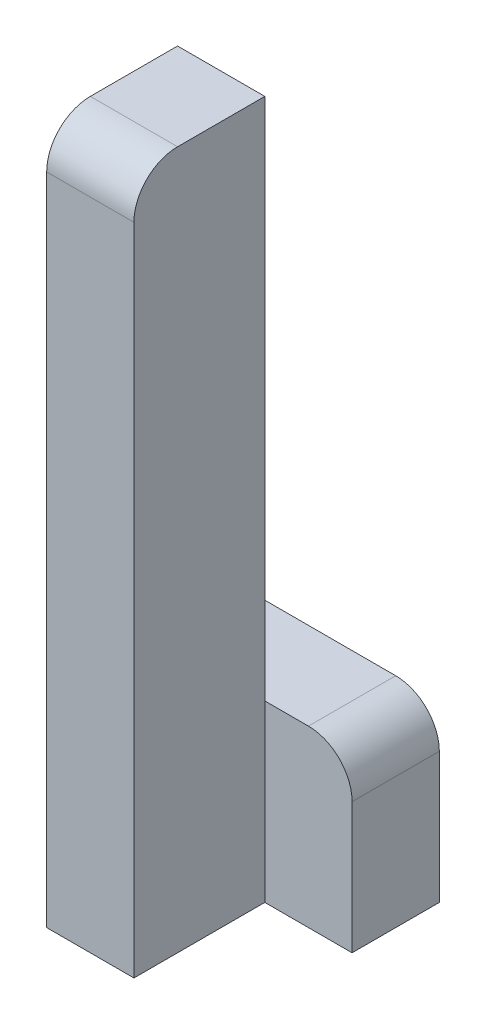
ISO-10303-21;
HEADER;
FILE_DESCRIPTION(('STEP AP214'),'2;1');
FILE_NAME('part.step','',(''),(''),'','','');
FILE_SCHEMA(('AUTOMOTIVE_DESIGN { 1 0 10303 214 1 1 1 1 }'));
ENDSEC;
DATA;
#1=APPLICATION_CONTEXT('core data for automotive mechanical design processes');
#2=APPLICATION_PROTOCOL_DEFINITION('international standard','automotive_design',2000,#1);
#3=PRODUCT_CONTEXT('',#1,'mechanical');
#4=PRODUCT('Part','Part','',(#3));
#5=PRODUCT_RELATED_PRODUCT_CATEGORY('part','',(#4));
#6=PRODUCT_DEFINITION_FORMATION('','',#4);
#7=PRODUCT_DEFINITION_CONTEXT('part definition',#1,'design');
#8=PRODUCT_DEFINITION('design','',#6,#7);
#9=PRODUCT_DEFINITION_SHAPE('','',#8);
#10=(LENGTH_UNIT() NAMED_UNIT(*) SI_UNIT(.MILLI.,.METRE.));
#11=(NAMED_UNIT(*) PLANE_ANGLE_UNIT() SI_UNIT($,.RADIAN.));
#12=(NAMED_UNIT(*) SI_UNIT($,.STERADIAN.) SOLID_ANGLE_UNIT());
#13=UNCERTAINTY_MEASURE_WITH_UNIT(LENGTH_MEASURE(1.E-05),#10,'distance_accuracy_value','');
#14=(GEOMETRIC_REPRESENTATION_CONTEXT(3) GLOBAL_UNCERTAINTY_ASSIGNED_CONTEXT((#13)) GLOBAL_UNIT_ASSIGNED_CONTEXT((#10,
#11,#12)) REPRESENTATION_CONTEXT('',''));
#15=CARTESIAN_POINT('',(0.,0.,0.));
#16=DIRECTION('',(0.,0.,1.));
#17=DIRECTION('',(1.,0.,0.));
#18=AXIS2_PLACEMENT_3D('',#15,#16,#17);
#19=CARTESIAN_POINT('',(-10.,0.,30.));
#20=DIRECTION('',(0.,-1.,0.));
#21=DIRECTION('',(1.,0.,0.));
#22=AXIS2_PLACEMENT_3D('',#19,#20,#21);
#23=PLANE('',#22);
#24=DIRECTION('',(0.,0.,-1.));
#25=VECTOR('',#24,1.);
#26=CARTESIAN_POINT('',(-30.,0.,30.));
#27=LINE('',#26,#25);
#28=CARTESIAN_POINT('',(-30.,0.,20.));
#29=VERTEX_POINT('',#28);
#30=CARTESIAN_POINT('',(-30.,0.,0.));
#31=VERTEX_POINT('',#30);
#32=EDGE_CURVE('E171',#29,#31,#27,.T.);
#33=ORIENTED_EDGE('',*,*,#32,.F.);
#34=DIRECTION('',(-1.,0.,0.));
#35=VECTOR('',#34,1.);
#36=CARTESIAN_POINT('',(-10.,0.,20.));
#37=LINE('',#36,#35);
#38=CARTESIAN_POINT('',(-10.,0.,20.));
#39=VERTEX_POINT('',#38);
#40=EDGE_CURVE('E43',#29,#39,#37,.F.);
#41=ORIENTED_EDGE('',*,*,#40,.T.);
#42=DIRECTION('',(0.,0.,-1.));
#43=VECTOR('',#42,1.);
#44=CARTESIAN_POINT('',(-10.,0.,30.));
#45=LINE('',#44,#43);
#46=CARTESIAN_POINT('',(-10.,0.,0.));
#47=VERTEX_POINT('',#46);
#48=EDGE_CURVE('E158',#39,#47,#45,.T.);
#49=ORIENTED_EDGE('',*,*,#48,.T.);
#50=DIRECTION('',(-1.,0.,0.));
#51=VECTOR('',#50,1.);
#52=CARTESIAN_POINT('',(-10.,0.,0.));
#53=LINE('',#52,#51);
#54=EDGE_CURVE('E148',#47,#31,#53,.T.);
#55=ORIENTED_EDGE('',*,*,#54,.T.);
#56=EDGE_LOOP('',(#33,#41,#49,#55));
#57=FACE_BOUND('',#56,.T.);
#58=ADVANCED_FACE('F35',(#57),#23,.F.);
#59=CARTESIAN_POINT('',(-30.,0.,30.));
#60=DIRECTION('',(1.,0.,0.));
#61=DIRECTION('',(0.,0.,-1.));
#62=AXIS2_PLACEMENT_3D('',#59,#60,#61);
#63=PLANE('',#62);
#64=DIRECTION('',(0.,-1.,0.));
#65=VECTOR('',#64,1.);
#66=CARTESIAN_POINT('',(-30.,0.,30.));
#67=LINE('',#66,#65);
#68=CARTESIAN_POINT('',(-30.,-10.,30.));
#69=VERTEX_POINT('',#68);
#70=CARTESIAN_POINT('',(-30.,-160.,30.));
#71=VERTEX_POINT('',#70);
#72=EDGE_CURVE('E150',#69,#71,#67,.T.);
#73=ORIENTED_EDGE('',*,*,#72,.F.);
#74=CARTESIAN_POINT('',(-30.,-10.,20.));
#75=DIRECTION('',(1.,0.,0.));
#76=DIRECTION('',(0.,0.,-1.));
#77=AXIS2_PLACEMENT_3D('',#74,#75,#76);
#78=CIRCLE('',#77,10.);
#79=EDGE_CURVE('E57',#69,#29,#78,.F.);
#80=ORIENTED_EDGE('',*,*,#79,.T.);
#81=ORIENTED_EDGE('',*,*,#32,.T.);
#82=DIRECTION('',(0.,-1.,0.));
#83=VECTOR('',#82,1.);
#84=CARTESIAN_POINT('',(-30.,0.,0.));
#85=LINE('',#84,#83);
#86=CARTESIAN_POINT('',(-30.,-120.,0.));
#87=VERTEX_POINT('',#86);
#88=EDGE_CURVE('E126',#31,#87,#85,.T.);
#89=ORIENTED_EDGE('',*,*,#88,.T.);
#90=DIRECTION('',(0.,0.,1.));
#91=VECTOR('',#90,1.);
#92=CARTESIAN_POINT('',(-30.,-120.,-20.));
#93=LINE('',#92,#91);
#94=CARTESIAN_POINT('',(-30.,-120.,-20.));
#95=VERTEX_POINT('',#94);
#96=EDGE_CURVE('E111',#95,#87,#93,.T.);
#97=ORIENTED_EDGE('',*,*,#96,.F.);
#98=DIRECTION('',(0.,-1.,0.));
#99=VECTOR('',#98,1.);
#100=CARTESIAN_POINT('',(-30.,-120.,-20.));
#101=LINE('',#100,#99);
#102=CARTESIAN_POINT('',(-30.,-160.,-20.));
#103=VERTEX_POINT('',#102);
#104=EDGE_CURVE('E118',#95,#103,#101,.T.);
#105=ORIENTED_EDGE('',*,*,#104,.T.);
#106=DIRECTION('',(0.,0.,-1.));
#107=VECTOR('',#106,1.);
#108=CARTESIAN_POINT('',(-30.,-160.,30.));
#109=LINE('',#108,#107);
#110=EDGE_CURVE('E169',#71,#103,#109,.T.);
#111=ORIENTED_EDGE('',*,*,#110,.F.);
#112=EDGE_LOOP('',(#73,#80,#81,#89,#97,#105,#111));
#113=FACE_BOUND('',#112,.T.);
#114=ADVANCED_FACE('F123',(#113),#63,.F.);
#115=CARTESIAN_POINT('',(-30.,-160.,30.));
#116=DIRECTION('',(0.,1.,0.));
#117=DIRECTION('',(0.,0.,1.));
#118=AXIS2_PLACEMENT_3D('',#115,#116,#117);
#119=PLANE('',#118);
#120=ORIENTED_EDGE('',*,*,#110,.T.);
#121=DIRECTION('',(1.,0.,0.));
#122=VECTOR('',#121,1.);
#123=CARTESIAN_POINT('',(-30.,-160.,-20.));
#124=LINE('',#123,#122);
#125=CARTESIAN_POINT('',(10.,-160.,-20.));
#126=VERTEX_POINT('',#125);
#127=EDGE_CURVE('E134',#103,#126,#124,.T.);
#128=ORIENTED_EDGE('',*,*,#127,.T.);
#129=DIRECTION('',(0.,0.,1.));
#130=VECTOR('',#129,1.);
#131=CARTESIAN_POINT('',(10.,-160.,-20.));
#132=LINE('',#131,#130);
#133=CARTESIAN_POINT('',(10.,-160.,0.));
#134=VERTEX_POINT('',#133);
#135=EDGE_CURVE('E127',#126,#134,#132,.T.);
#136=ORIENTED_EDGE('',*,*,#135,.T.);
#137=DIRECTION('',(1.,0.,0.));
#138=VECTOR('',#137,1.);
#139=CARTESIAN_POINT('',(-30.,-160.,0.));
#140=LINE('',#139,#138);
#141=CARTESIAN_POINT('',(-10.,-160.,0.));
#142=VERTEX_POINT('',#141);
#143=EDGE_CURVE('E142',#142,#134,#140,.T.);
#144=ORIENTED_EDGE('',*,*,#143,.F.);
#145=DIRECTION('',(0.,0.,-1.));
#146=VECTOR('',#145,1.);
#147=CARTESIAN_POINT('',(-10.,-160.,30.));
#148=LINE('',#147,#146);
#149=CARTESIAN_POINT('',(-10.,-160.,30.));
#150=VERTEX_POINT('',#149);
#151=EDGE_CURVE('E166',#150,#142,#148,.T.);
#152=ORIENTED_EDGE('',*,*,#151,.F.);
#153=DIRECTION('',(1.,0.,0.));
#154=VECTOR('',#153,1.);
#155=CARTESIAN_POINT('',(-30.,-160.,30.));
#156=LINE('',#155,#154);
#157=EDGE_CURVE('E152',#71,#150,#156,.T.);
#158=ORIENTED_EDGE('',*,*,#157,.F.);
#159=EDGE_LOOP('',(#120,#128,#136,#144,#152,#158));
#160=FACE_BOUND('',#159,.T.);
#161=ADVANCED_FACE('F193',(#160),#119,.F.);
#162=CARTESIAN_POINT('',(-10.,-160.,30.));
#163=DIRECTION('',(-1.,0.,0.));
#164=DIRECTION('',(0.,0.,1.));
#165=AXIS2_PLACEMENT_3D('',#162,#163,#164);
#166=PLANE('',#165);
#167=ORIENTED_EDGE('',*,*,#48,.F.);
#168=CARTESIAN_POINT('',(-10.,-10.,20.));
#169=DIRECTION('',(-1.,0.,0.));
#170=DIRECTION('',(0.,0.,1.));
#171=AXIS2_PLACEMENT_3D('',#168,#169,#170);
#172=CIRCLE('',#171,10.);
#173=CARTESIAN_POINT('',(-10.,-10.,30.));
#174=VERTEX_POINT('',#173);
#175=EDGE_CURVE('E11',#39,#174,#172,.F.);
#176=ORIENTED_EDGE('',*,*,#175,.T.);
#177=DIRECTION('',(0.,1.,0.));
#178=VECTOR('',#177,1.);
#179=CARTESIAN_POINT('',(-10.,-160.,30.));
#180=LINE('',#179,#178);
#181=EDGE_CURVE('E155',#150,#174,#180,.T.);
#182=ORIENTED_EDGE('',*,*,#181,.F.);
#183=ORIENTED_EDGE('',*,*,#151,.T.);
#184=DIRECTION('',(0.,1.,0.));
#185=VECTOR('',#184,1.);
#186=CARTESIAN_POINT('',(-10.,-160.,0.));
#187=LINE('',#186,#185);
#188=CARTESIAN_POINT('',(-10.,-120.,0.));
#189=VERTEX_POINT('',#188);
#190=EDGE_CURVE('E153',#142,#189,#187,.T.);
#191=ORIENTED_EDGE('',*,*,#190,.T.);
#192=EDGE_CURVE('E162',#189,#47,#187,.T.);
#193=ORIENTED_EDGE('',*,*,#192,.T.);
#194=EDGE_LOOP('',(#167,#176,#182,#183,#191,#193));
#195=FACE_BOUND('',#194,.T.);
#196=ADVANCED_FACE('F196',(#195),#166,.F.);
#197=CARTESIAN_POINT('',(0.,0.,30.));
#198=DIRECTION('',(0.,0.,1.));
#199=DIRECTION('',(1.,0.,0.));
#200=AXIS2_PLACEMENT_3D('',#197,#198,#199);
#201=PLANE('',#200);
#202=ORIENTED_EDGE('',*,*,#181,.T.);
#203=DIRECTION('',(-1.,0.,0.));
#204=VECTOR('',#203,1.);
#205=CARTESIAN_POINT('',(-30.,-10.,30.));
#206=LINE('',#205,#204);
#207=EDGE_CURVE('E181',#174,#69,#206,.T.);
#208=ORIENTED_EDGE('',*,*,#207,.T.);
#209=ORIENTED_EDGE('',*,*,#72,.T.);
#210=ORIENTED_EDGE('',*,*,#157,.T.);
#211=EDGE_LOOP('',(#202,#208,#209,#210));
#212=FACE_BOUND('',#211,.T.);
#213=ADVANCED_FACE('F186',(#212),#201,.T.);
#214=CARTESIAN_POINT('',(0.,0.,0.));
#215=DIRECTION('',(0.,0.,1.));
#216=DIRECTION('',(1.,0.,0.));
#217=AXIS2_PLACEMENT_3D('',#214,#215,#216);
#218=PLANE('',#217);
#219=ORIENTED_EDGE('',*,*,#192,.F.);
#220=DIRECTION('',(-1.,0.,0.));
#221=VECTOR('',#220,1.);
#222=CARTESIAN_POINT('',(10.,-120.,0.));
#223=LINE('',#222,#221);
#224=EDGE_CURVE('E143',#189,#87,#223,.T.);
#225=ORIENTED_EDGE('',*,*,#224,.T.);
#226=ORIENTED_EDGE('',*,*,#88,.F.);
#227=ORIENTED_EDGE('',*,*,#54,.F.);
#228=EDGE_LOOP('',(#219,#225,#226,#227));
#229=FACE_BOUND('',#228,.T.);
#230=ADVANCED_FACE('F215',(#229),#218,.F.);
#231=CARTESIAN_POINT('',(0.,0.,0.));
#232=DIRECTION('',(0.,0.,1.));
#233=DIRECTION('',(1.,0.,0.));
#234=AXIS2_PLACEMENT_3D('',#231,#232,#233);
#235=PLANE('',#234);
#236=DIRECTION('',(0.,1.,0.));
#237=VECTOR('',#236,1.);
#238=CARTESIAN_POINT('',(10.,-160.,0.));
#239=LINE('',#238,#237);
#240=CARTESIAN_POINT('',(10.,-130.,0.));
#241=VERTEX_POINT('',#240);
#242=EDGE_CURVE('E119',#134,#241,#239,.T.);
#243=ORIENTED_EDGE('',*,*,#242,.T.);
#244=CARTESIAN_POINT('',(0.,-130.,0.));
#245=DIRECTION('',(0.,0.,1.));
#246=DIRECTION('',(1.,0.,0.));
#247=AXIS2_PLACEMENT_3D('',#244,#245,#246);
#248=CIRCLE('',#247,10.);
#249=CARTESIAN_POINT('',(0.,-120.,0.));
#250=VERTEX_POINT('',#249);
#251=EDGE_CURVE('E176',#241,#250,#248,.T.);
#252=ORIENTED_EDGE('',*,*,#251,.T.);
#253=EDGE_CURVE('E140',#250,#189,#223,.T.);
#254=ORIENTED_EDGE('',*,*,#253,.T.);
#255=ORIENTED_EDGE('',*,*,#190,.F.);
#256=ORIENTED_EDGE('',*,*,#143,.T.);
#257=EDGE_LOOP('',(#243,#252,#254,#255,#256));
#258=FACE_BOUND('',#257,.T.);
#259=ADVANCED_FACE('F218',(#258),#235,.T.);
#260=CARTESIAN_POINT('',(10.,-120.,-20.));
#261=DIRECTION('',(0.,1.,0.));
#262=DIRECTION('',(0.,0.,1.));
#263=AXIS2_PLACEMENT_3D('',#260,#261,#262);
#264=PLANE('',#263);
#265=ORIENTED_EDGE('',*,*,#253,.F.);
#266=DIRECTION('',(0.,0.,1.));
#267=VECTOR('',#266,1.);
#268=CARTESIAN_POINT('',(0.,-120.,-20.));
#269=LINE('',#268,#267);
#270=CARTESIAN_POINT('',(0.,-120.,-20.));
#271=VERTEX_POINT('',#270);
#272=EDGE_CURVE('E114',#250,#271,#269,.F.);
#273=ORIENTED_EDGE('',*,*,#272,.T.);
#274=DIRECTION('',(-1.,0.,0.));
#275=VECTOR('',#274,1.);
#276=CARTESIAN_POINT('',(10.,-120.,-20.));
#277=LINE('',#276,#275);
#278=EDGE_CURVE('E106',#271,#95,#277,.T.);
#279=ORIENTED_EDGE('',*,*,#278,.T.);
#280=ORIENTED_EDGE('',*,*,#96,.T.);
#281=ORIENTED_EDGE('',*,*,#224,.F.);
#282=EDGE_LOOP('',(#265,#273,#279,#280,#281));
#283=FACE_BOUND('',#282,.T.);
#284=ADVANCED_FACE('F109',(#283),#264,.T.);
#285=CARTESIAN_POINT('',(10.,-160.,-20.));
#286=DIRECTION('',(1.,0.,0.));
#287=DIRECTION('',(0.,0.,-1.));
#288=AXIS2_PLACEMENT_3D('',#285,#286,#287);
#289=PLANE('',#288);
#290=DIRECTION('',(0.,1.,0.));
#291=VECTOR('',#290,1.);
#292=CARTESIAN_POINT('',(10.,-160.,-20.));
#293=LINE('',#292,#291);
#294=CARTESIAN_POINT('',(10.,-130.,-20.));
#295=VERTEX_POINT('',#294);
#296=EDGE_CURVE('E128',#126,#295,#293,.T.);
#297=ORIENTED_EDGE('',*,*,#296,.T.);
#298=DIRECTION('',(0.,0.,1.));
#299=VECTOR('',#298,1.);
#300=CARTESIAN_POINT('',(10.,-130.,-20.));
#301=LINE('',#300,#299);
#302=EDGE_CURVE('E173',#295,#241,#301,.T.);
#303=ORIENTED_EDGE('',*,*,#302,.T.);
#304=ORIENTED_EDGE('',*,*,#242,.F.);
#305=ORIENTED_EDGE('',*,*,#135,.F.);
#306=EDGE_LOOP('',(#297,#303,#304,#305));
#307=FACE_BOUND('',#306,.T.);
#308=ADVANCED_FACE('F224',(#307),#289,.T.);
#309=CARTESIAN_POINT('',(0.,0.,-20.));
#310=DIRECTION('',(0.,0.,1.));
#311=DIRECTION('',(1.,0.,0.));
#312=AXIS2_PLACEMENT_3D('',#309,#310,#311);
#313=PLANE('',#312);
#314=ORIENTED_EDGE('',*,*,#278,.F.);
#315=CARTESIAN_POINT('',(0.,-130.,-20.));
#316=DIRECTION('',(0.,0.,1.));
#317=DIRECTION('',(1.,0.,0.));
#318=AXIS2_PLACEMENT_3D('',#315,#316,#317);
#319=CIRCLE('',#318,10.);
#320=EDGE_CURVE('E179',#271,#295,#319,.F.);
#321=ORIENTED_EDGE('',*,*,#320,.T.);
#322=ORIENTED_EDGE('',*,*,#296,.F.);
#323=ORIENTED_EDGE('',*,*,#127,.F.);
#324=ORIENTED_EDGE('',*,*,#104,.F.);
#325=EDGE_LOOP('',(#314,#321,#322,#323,#324));
#326=FACE_BOUND('',#325,.T.);
#327=ADVANCED_FACE('F131',(#326),#313,.F.);
#328=CARTESIAN_POINT('',(0.,-130.,-20.));
#329=DIRECTION('',(0.,0.,1.));
#330=DIRECTION('',(1.,0.,0.));
#331=AXIS2_PLACEMENT_3D('',#328,#329,#330);
#332=CYLINDRICAL_SURFACE('',#331,10.);
#333=ORIENTED_EDGE('',*,*,#320,.F.);
#334=ORIENTED_EDGE('',*,*,#272,.F.);
#335=ORIENTED_EDGE('',*,*,#251,.F.);
#336=ORIENTED_EDGE('',*,*,#302,.F.);
#337=EDGE_LOOP('',(#333,#334,#335,#336));
#338=FACE_BOUND('',#337,.T.);
#339=ADVANCED_FACE('F199',(#338),#332,.T.);
#340=CARTESIAN_POINT('',(0.,-10.,20.));
#341=DIRECTION('',(1.,0.,0.));
#342=DIRECTION('',(0.,1.,0.));
#343=AXIS2_PLACEMENT_3D('',#340,#341,#342);
#344=CYLINDRICAL_SURFACE('',#343,10.);
#345=ORIENTED_EDGE('',*,*,#175,.F.);
#346=ORIENTED_EDGE('',*,*,#40,.F.);
#347=ORIENTED_EDGE('',*,*,#79,.F.);
#348=ORIENTED_EDGE('',*,*,#207,.F.);
#349=EDGE_LOOP('',(#345,#346,#347,#348));
#350=FACE_BOUND('',#349,.T.);
#351=ADVANCED_FACE('F37',(#350),#344,.T.);
#352=CLOSED_SHELL('',(#58,#114,#161,#196,#213,#230,#259,#284,#308,#327,#339,#351));
#353=MANIFOLD_SOLID_BREP('B2',#352);
#354=ADVANCED_BREP_SHAPE_REPRESENTATION('',(#18,#353),#14);
#355=SHAPE_DEFINITION_REPRESENTATION(#9,#354);
ENDSEC;
END-ISO-10303-21;
